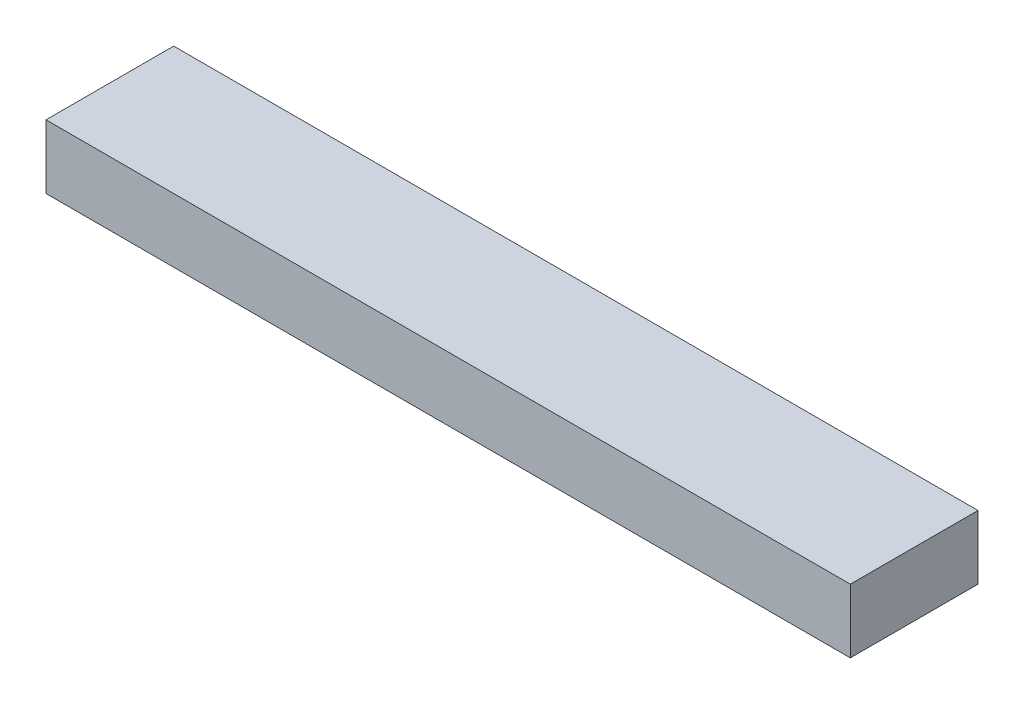
ISO-10303-21;
HEADER;
FILE_DESCRIPTION(('STEP AP214'),'2;1');
FILE_NAME('part.step','',(''),(''),'','','');
FILE_SCHEMA(('AUTOMOTIVE_DESIGN { 1 0 10303 214 1 1 1 1 }'));
ENDSEC;
DATA;
#1=APPLICATION_CONTEXT('core data for automotive mechanical design processes');
#2=APPLICATION_PROTOCOL_DEFINITION('international standard','automotive_design',2000,#1);
#3=PRODUCT_CONTEXT('',#1,'mechanical');
#4=PRODUCT('Part','Part','',(#3));
#5=PRODUCT_RELATED_PRODUCT_CATEGORY('part','',(#4));
#6=PRODUCT_DEFINITION_FORMATION('','',#4);
#7=PRODUCT_DEFINITION_CONTEXT('part definition',#1,'design');
#8=PRODUCT_DEFINITION('design','',#6,#7);
#9=PRODUCT_DEFINITION_SHAPE('','',#8);
#10=(LENGTH_UNIT() NAMED_UNIT(*) SI_UNIT(.MILLI.,.METRE.));
#11=(NAMED_UNIT(*) PLANE_ANGLE_UNIT() SI_UNIT($,.RADIAN.));
#12=(NAMED_UNIT(*) SI_UNIT($,.STERADIAN.) SOLID_ANGLE_UNIT());
#13=UNCERTAINTY_MEASURE_WITH_UNIT(LENGTH_MEASURE(1.E-05),#10,'distance_accuracy_value','');
#14=(GEOMETRIC_REPRESENTATION_CONTEXT(3) GLOBAL_UNCERTAINTY_ASSIGNED_CONTEXT((#13)) GLOBAL_UNIT_ASSIGNED_CONTEXT((#10,
#11,#12)) REPRESENTATION_CONTEXT('',''));
#15=CARTESIAN_POINT('',(0.,0.,0.));
#16=DIRECTION('',(0.,0.,1.));
#17=DIRECTION('',(1.,0.,0.));
#18=AXIS2_PLACEMENT_3D('',#15,#16,#17);
#19=CARTESIAN_POINT('',(320.,0.,0.));
#20=DIRECTION('',(0.,0.,-1.));
#21=DIRECTION('',(-1.,0.,0.));
#22=AXIS2_PLACEMENT_3D('',#19,#20,#21);
#23=PLANE('',#22);
#24=DIRECTION('',(0.,-1.,0.));
#25=VECTOR('',#24,1.);
#26=CARTESIAN_POINT('',(0.,0.,0.));
#27=LINE('',#26,#25);
#28=CARTESIAN_POINT('',(0.,25.4,0.));
#29=VERTEX_POINT('',#28);
#30=CARTESIAN_POINT('',(0.,0.,0.));
#31=VERTEX_POINT('',#30);
#32=EDGE_CURVE('E107',#29,#31,#27,.T.);
#33=ORIENTED_EDGE('',*,*,#32,.T.);
#34=DIRECTION('',(-1.,0.,0.));
#35=VECTOR('',#34,1.);
#36=CARTESIAN_POINT('',(320.,0.,0.));
#37=LINE('',#36,#35);
#38=CARTESIAN_POINT('',(320.,0.,0.));
#39=VERTEX_POINT('',#38);
#40=EDGE_CURVE('E11',#39,#31,#37,.T.);
#41=ORIENTED_EDGE('',*,*,#40,.F.);
#42=DIRECTION('',(0.,-1.,0.));
#43=VECTOR('',#42,1.);
#44=CARTESIAN_POINT('',(320.,0.,0.));
#45=LINE('',#44,#43);
#46=CARTESIAN_POINT('',(320.,25.4,0.));
#47=VERTEX_POINT('',#46);
#48=EDGE_CURVE('E91',#47,#39,#45,.T.);
#49=ORIENTED_EDGE('',*,*,#48,.F.);
#50=DIRECTION('',(-1.,0.,0.));
#51=VECTOR('',#50,1.);
#52=CARTESIAN_POINT('',(320.,25.4,0.));
#53=LINE('',#52,#51);
#54=EDGE_CURVE('E103',#47,#29,#53,.T.);
#55=ORIENTED_EDGE('',*,*,#54,.T.);
#56=EDGE_LOOP('',(#33,#41,#49,#55));
#57=FACE_BOUND('',#56,.T.);
#58=ADVANCED_FACE('F39',(#57),#23,.F.);
#59=CARTESIAN_POINT('',(320.,0.,0.));
#60=DIRECTION('',(0.,1.,0.));
#61=DIRECTION('',(0.,0.,1.));
#62=AXIS2_PLACEMENT_3D('',#59,#60,#61);
#63=PLANE('',#62);
#64=DIRECTION('',(0.,0.,-1.));
#65=VECTOR('',#64,1.);
#66=CARTESIAN_POINT('',(0.,0.,0.));
#67=LINE('',#66,#65);
#68=CARTESIAN_POINT('',(0.,0.,-50.8));
#69=VERTEX_POINT('',#68);
#70=EDGE_CURVE('E96',#31,#69,#67,.T.);
#71=ORIENTED_EDGE('',*,*,#70,.T.);
#72=DIRECTION('',(-1.,0.,0.));
#73=VECTOR('',#72,1.);
#74=CARTESIAN_POINT('',(320.,0.,-50.8));
#75=LINE('',#74,#73);
#76=CARTESIAN_POINT('',(320.,0.,-50.8));
#77=VERTEX_POINT('',#76);
#78=EDGE_CURVE('E48',#77,#69,#75,.T.);
#79=ORIENTED_EDGE('',*,*,#78,.F.);
#80=DIRECTION('',(0.,0.,-1.));
#81=VECTOR('',#80,1.);
#82=CARTESIAN_POINT('',(320.,0.,0.));
#83=LINE('',#82,#81);
#84=EDGE_CURVE('E86',#39,#77,#83,.T.);
#85=ORIENTED_EDGE('',*,*,#84,.F.);
#86=ORIENTED_EDGE('',*,*,#40,.T.);
#87=EDGE_LOOP('',(#71,#79,#85,#86));
#88=FACE_BOUND('',#87,.T.);
#89=ADVANCED_FACE('F95',(#88),#63,.F.);
#90=CARTESIAN_POINT('',(320.,0.,-50.8));
#91=DIRECTION('',(0.,0.,1.));
#92=DIRECTION('',(1.,0.,0.));
#93=AXIS2_PLACEMENT_3D('',#90,#91,#92);
#94=PLANE('',#93);
#95=DIRECTION('',(0.,1.,0.));
#96=VECTOR('',#95,1.);
#97=CARTESIAN_POINT('',(0.,0.,-50.8));
#98=LINE('',#97,#96);
#99=CARTESIAN_POINT('',(0.,25.4,-50.8));
#100=VERTEX_POINT('',#99);
#101=EDGE_CURVE('E73',#69,#100,#98,.T.);
#102=ORIENTED_EDGE('',*,*,#101,.T.);
#103=DIRECTION('',(-1.,0.,0.));
#104=VECTOR('',#103,1.);
#105=CARTESIAN_POINT('',(320.,25.4,-50.8));
#106=LINE('',#105,#104);
#107=CARTESIAN_POINT('',(320.,25.4,-50.8));
#108=VERTEX_POINT('',#107);
#109=EDGE_CURVE('E98',#108,#100,#106,.T.);
#110=ORIENTED_EDGE('',*,*,#109,.F.);
#111=DIRECTION('',(0.,1.,0.));
#112=VECTOR('',#111,1.);
#113=CARTESIAN_POINT('',(320.,0.,-50.8));
#114=LINE('',#113,#112);
#115=EDGE_CURVE('E89',#77,#108,#114,.T.);
#116=ORIENTED_EDGE('',*,*,#115,.F.);
#117=ORIENTED_EDGE('',*,*,#78,.T.);
#118=EDGE_LOOP('',(#102,#110,#116,#117));
#119=FACE_BOUND('',#118,.T.);
#120=ADVANCED_FACE('F99',(#119),#94,.F.);
#121=CARTESIAN_POINT('',(320.,25.4,0.));
#122=DIRECTION('',(0.,-1.,0.));
#123=DIRECTION('',(0.,0.,-1.));
#124=AXIS2_PLACEMENT_3D('',#121,#122,#123);
#125=PLANE('',#124);
#126=DIRECTION('',(0.,0.,1.));
#127=VECTOR('',#126,1.);
#128=CARTESIAN_POINT('',(0.,25.4,0.));
#129=LINE('',#128,#127);
#130=EDGE_CURVE('E79',#100,#29,#129,.T.);
#131=ORIENTED_EDGE('',*,*,#130,.T.);
#132=ORIENTED_EDGE('',*,*,#54,.F.);
#133=DIRECTION('',(0.,0.,1.));
#134=VECTOR('',#133,1.);
#135=CARTESIAN_POINT('',(320.,25.4,0.));
#136=LINE('',#135,#134);
#137=EDGE_CURVE('E56',#108,#47,#136,.T.);
#138=ORIENTED_EDGE('',*,*,#137,.F.);
#139=ORIENTED_EDGE('',*,*,#109,.T.);
#140=EDGE_LOOP('',(#131,#132,#138,#139));
#141=FACE_BOUND('',#140,.T.);
#142=ADVANCED_FACE('F120',(#141),#125,.F.);
#143=CARTESIAN_POINT('',(320.,0.,0.));
#144=DIRECTION('',(-1.,0.,0.));
#145=DIRECTION('',(0.,0.,1.));
#146=AXIS2_PLACEMENT_3D('',#143,#144,#145);
#147=PLANE('',#146);
#148=ORIENTED_EDGE('',*,*,#48,.T.);
#149=ORIENTED_EDGE('',*,*,#84,.T.);
#150=ORIENTED_EDGE('',*,*,#115,.T.);
#151=ORIENTED_EDGE('',*,*,#137,.T.);
#152=EDGE_LOOP('',(#148,#149,#150,#151));
#153=FACE_BOUND('',#152,.T.);
#154=ADVANCED_FACE('F87',(#153),#147,.F.);
#155=CARTESIAN_POINT('',(0.,0.,0.));
#156=DIRECTION('',(-1.,0.,0.));
#157=DIRECTION('',(0.,0.,1.));
#158=AXIS2_PLACEMENT_3D('',#155,#156,#157);
#159=PLANE('',#158);
#160=ORIENTED_EDGE('',*,*,#32,.F.);
#161=ORIENTED_EDGE('',*,*,#130,.F.);
#162=ORIENTED_EDGE('',*,*,#101,.F.);
#163=ORIENTED_EDGE('',*,*,#70,.F.);
#164=EDGE_LOOP('',(#160,#161,#162,#163));
#165=FACE_BOUND('',#164,.T.);
#166=ADVANCED_FACE('F123',(#165),#159,.T.);
#167=CLOSED_SHELL('',(#58,#89,#120,#142,#154,#166));
#168=MANIFOLD_SOLID_BREP('B2',#167);
#169=ADVANCED_BREP_SHAPE_REPRESENTATION('',(#18,#168),#14);
#170=SHAPE_DEFINITION_REPRESENTATION(#9,#169);
ENDSEC;
END-ISO-10303-21;
